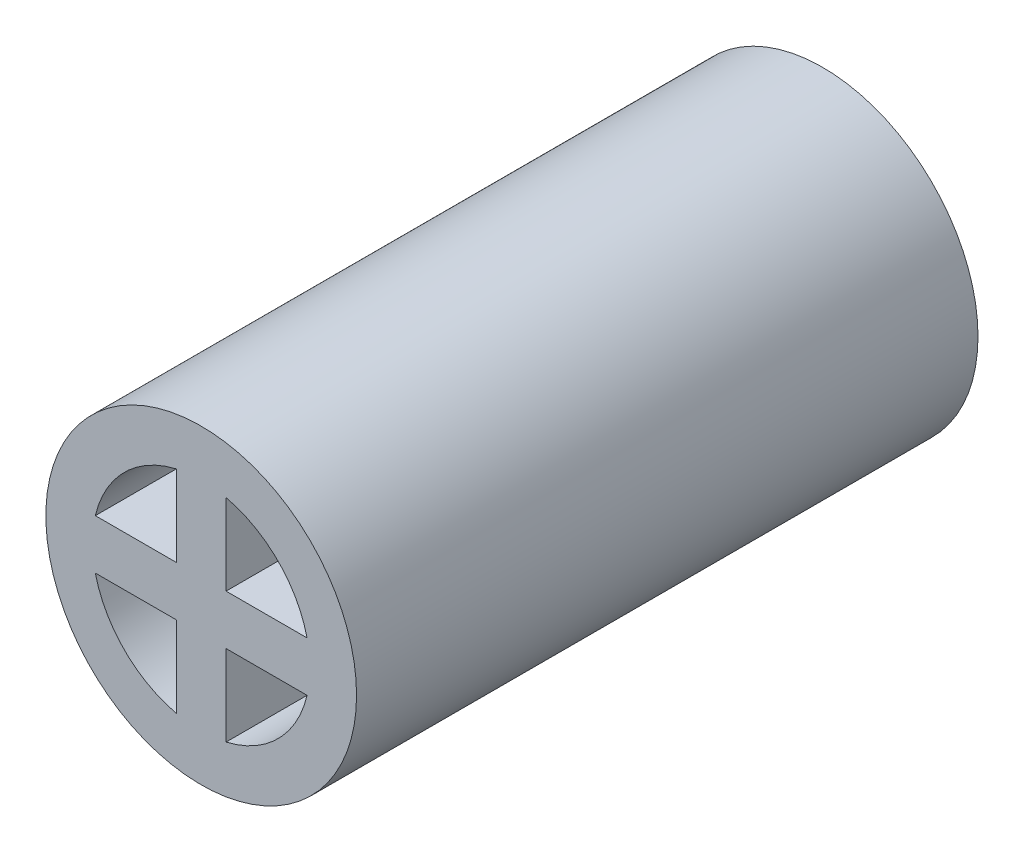
ISO-10303-21;
HEADER;
FILE_DESCRIPTION(('STEP AP214'),'2;1');
FILE_NAME('part.step','',(''),(''),'','','');
FILE_SCHEMA(('AUTOMOTIVE_DESIGN { 1 0 10303 214 1 1 1 1 }'));
ENDSEC;
DATA;
#1=APPLICATION_CONTEXT('core data for automotive mechanical design processes');
#2=APPLICATION_PROTOCOL_DEFINITION('international standard','automotive_design',2000,#1);
#3=PRODUCT_CONTEXT('',#1,'mechanical');
#4=PRODUCT('Part','Part','',(#3));
#5=PRODUCT_RELATED_PRODUCT_CATEGORY('part','',(#4));
#6=PRODUCT_DEFINITION_FORMATION('','',#4);
#7=PRODUCT_DEFINITION_CONTEXT('part definition',#1,'design');
#8=PRODUCT_DEFINITION('design','',#6,#7);
#9=PRODUCT_DEFINITION_SHAPE('','',#8);
#10=(LENGTH_UNIT() NAMED_UNIT(*) SI_UNIT(.MILLI.,.METRE.));
#11=(NAMED_UNIT(*) PLANE_ANGLE_UNIT() SI_UNIT($,.RADIAN.));
#12=(NAMED_UNIT(*) SI_UNIT($,.STERADIAN.) SOLID_ANGLE_UNIT());
#13=UNCERTAINTY_MEASURE_WITH_UNIT(LENGTH_MEASURE(1.E-05),#10,'distance_accuracy_value','');
#14=(GEOMETRIC_REPRESENTATION_CONTEXT(3) GLOBAL_UNCERTAINTY_ASSIGNED_CONTEXT((#13)) GLOBAL_UNIT_ASSIGNED_CONTEXT((#10,
#11,#12)) REPRESENTATION_CONTEXT('',''));
#15=CARTESIAN_POINT('',(0.,0.,0.));
#16=DIRECTION('',(0.,0.,1.));
#17=DIRECTION('',(1.,0.,0.));
#18=AXIS2_PLACEMENT_3D('',#15,#16,#17);
#19=CARTESIAN_POINT('',(0.,0.,50.));
#20=DIRECTION('',(0.,0.,-1.));
#21=DIRECTION('',(-1.,0.,0.));
#22=AXIS2_PLACEMENT_3D('',#19,#20,#21);
#23=CYLINDRICAL_SURFACE('',#22,8.75);
#24=CARTESIAN_POINT('',(0.,0.,0.));
#25=DIRECTION('',(0.,0.,1.));
#26=DIRECTION('',(1.,0.,0.));
#27=AXIS2_PLACEMENT_3D('',#24,#25,#26);
#28=CIRCLE('',#27,8.75);
#29=CARTESIAN_POINT('',(-2.,8.51836251870041,0.));
#30=VERTEX_POINT('',#29);
#31=CARTESIAN_POINT('',(-8.51836251870041,2.,0.));
#32=VERTEX_POINT('',#31);
#33=EDGE_CURVE('E202',#30,#32,#28,.T.);
#34=ORIENTED_EDGE('',*,*,#33,.F.);
#35=DIRECTION('',(0.,0.,-1.));
#36=VECTOR('',#35,1.);
#37=CARTESIAN_POINT('',(-2.,8.51836251870041,74.7487373415292));
#38=LINE('',#37,#36);
#39=CARTESIAN_POINT('',(-2.,8.51836251870041,50.));
#40=VERTEX_POINT('',#39);
#41=EDGE_CURVE('E172',#40,#30,#38,.T.);
#42=ORIENTED_EDGE('',*,*,#41,.F.);
#43=CARTESIAN_POINT('',(0.,0.,50.));
#44=DIRECTION('',(0.,0.,1.));
#45=DIRECTION('',(1.,0.,0.));
#46=AXIS2_PLACEMENT_3D('',#43,#44,#45);
#47=CIRCLE('',#46,8.75);
#48=CARTESIAN_POINT('',(-8.51836251870041,2.,50.));
#49=VERTEX_POINT('',#48);
#50=EDGE_CURVE('E199',#40,#49,#47,.T.);
#51=ORIENTED_EDGE('',*,*,#50,.T.);
#52=DIRECTION('',(0.,0.,-1.));
#53=VECTOR('',#52,1.);
#54=CARTESIAN_POINT('',(-8.51836251870041,2.,74.7487373415292));
#55=LINE('',#54,#53);
#56=EDGE_CURVE('E178',#49,#32,#55,.T.);
#57=ORIENTED_EDGE('',*,*,#56,.T.);
#58=EDGE_LOOP('',(#34,#42,#51,#57));
#59=FACE_BOUND('',#58,.T.);
#60=ADVANCED_FACE('F35',(#59),#23,.F.);
#61=CARTESIAN_POINT('',(-8.51836251870041,-2.,0.));
#62=VERTEX_POINT('',#61);
#63=CARTESIAN_POINT('',(-2.,-8.51836251870041,0.));
#64=VERTEX_POINT('',#63);
#65=EDGE_CURVE('E149',#62,#64,#28,.T.);
#66=ORIENTED_EDGE('',*,*,#65,.F.);
#67=DIRECTION('',(0.,0.,-1.));
#68=VECTOR('',#67,1.);
#69=CARTESIAN_POINT('',(-8.51836251870042,-2.,74.7487373415292));
#70=LINE('',#69,#68);
#71=CARTESIAN_POINT('',(-8.51836251870042,-2.,50.));
#72=VERTEX_POINT('',#71);
#73=EDGE_CURVE('E180',#72,#62,#70,.T.);
#74=ORIENTED_EDGE('',*,*,#73,.F.);
#75=CARTESIAN_POINT('',(-2.,-8.51836251870041,50.));
#76=VERTEX_POINT('',#75);
#77=EDGE_CURVE('E204',#72,#76,#47,.T.);
#78=ORIENTED_EDGE('',*,*,#77,.T.);
#79=DIRECTION('',(0.,0.,-1.));
#80=VECTOR('',#79,1.);
#81=CARTESIAN_POINT('',(-2.,-8.51836251870041,74.7487373415292));
#82=LINE('',#81,#80);
#83=EDGE_CURVE('E187',#76,#64,#82,.T.);
#84=ORIENTED_EDGE('',*,*,#83,.T.);
#85=EDGE_LOOP('',(#66,#74,#78,#84));
#86=FACE_BOUND('',#85,.T.);
#87=ADVANCED_FACE('F239',(#86),#23,.F.);
#88=CARTESIAN_POINT('',(2.,-8.51836251870041,0.));
#89=VERTEX_POINT('',#88);
#90=CARTESIAN_POINT('',(8.51836251870041,-2.,0.));
#91=VERTEX_POINT('',#90);
#92=EDGE_CURVE('E54',#89,#91,#28,.T.);
#93=ORIENTED_EDGE('',*,*,#92,.F.);
#94=DIRECTION('',(0.,0.,-1.));
#95=VECTOR('',#94,1.);
#96=CARTESIAN_POINT('',(2.,-8.51836251870041,74.7487373415292));
#97=LINE('',#96,#95);
#98=CARTESIAN_POINT('',(2.,-8.51836251870041,50.));
#99=VERTEX_POINT('',#98);
#100=EDGE_CURVE('E189',#99,#89,#97,.T.);
#101=ORIENTED_EDGE('',*,*,#100,.F.);
#102=CARTESIAN_POINT('',(8.51836251870041,-2.,50.));
#103=VERTEX_POINT('',#102);
#104=EDGE_CURVE('E200',#99,#103,#47,.T.);
#105=ORIENTED_EDGE('',*,*,#104,.T.);
#106=DIRECTION('',(0.,0.,-1.));
#107=VECTOR('',#106,1.);
#108=CARTESIAN_POINT('',(8.51836251870041,-2.,74.7487373415292));
#109=LINE('',#108,#107);
#110=EDGE_CURVE('E50',#103,#91,#109,.T.);
#111=ORIENTED_EDGE('',*,*,#110,.T.);
#112=EDGE_LOOP('',(#93,#101,#105,#111));
#113=FACE_BOUND('',#112,.T.);
#114=ADVANCED_FACE('F260',(#113),#23,.F.);
#115=CARTESIAN_POINT('',(8.51836251870041,2.,0.));
#116=VERTEX_POINT('',#115);
#117=CARTESIAN_POINT('',(2.,8.51836251870041,0.));
#118=VERTEX_POINT('',#117);
#119=EDGE_CURVE('E151',#116,#118,#28,.T.);
#120=ORIENTED_EDGE('',*,*,#119,.F.);
#121=DIRECTION('',(0.,0.,-1.));
#122=VECTOR('',#121,1.);
#123=CARTESIAN_POINT('',(8.51836251870041,2.,74.7487373415292));
#124=LINE('',#123,#122);
#125=CARTESIAN_POINT('',(8.51836251870041,2.,50.));
#126=VERTEX_POINT('',#125);
#127=EDGE_CURVE('E196',#126,#116,#124,.T.);
#128=ORIENTED_EDGE('',*,*,#127,.F.);
#129=CARTESIAN_POINT('',(2.,8.51836251870041,50.));
#130=VERTEX_POINT('',#129);
#131=EDGE_CURVE('E145',#126,#130,#47,.T.);
#132=ORIENTED_EDGE('',*,*,#131,.T.);
#133=DIRECTION('',(0.,0.,-1.));
#134=VECTOR('',#133,1.);
#135=CARTESIAN_POINT('',(2.,8.51836251870041,74.7487373415292));
#136=LINE('',#135,#134);
#137=EDGE_CURVE('E140',#130,#118,#136,.T.);
#138=ORIENTED_EDGE('',*,*,#137,.T.);
#139=EDGE_LOOP('',(#120,#128,#132,#138));
#140=FACE_BOUND('',#139,.T.);
#141=ADVANCED_FACE('F256',(#140),#23,.F.);
#142=CARTESIAN_POINT('',(0.,0.,50.));
#143=DIRECTION('',(0.,0.,1.));
#144=DIRECTION('',(1.,0.,0.));
#145=AXIS2_PLACEMENT_3D('',#142,#143,#144);
#146=PLANE('',#145);
#147=ORIENTED_EDGE('',*,*,#50,.F.);
#148=DIRECTION('',(0.,-1.,0.));
#149=VECTOR('',#148,1.);
#150=CARTESIAN_POINT('',(-2.,2.,50.));
#151=LINE('',#150,#149);
#152=CARTESIAN_POINT('',(-2.,2.,50.));
#153=VERTEX_POINT('',#152);
#154=EDGE_CURVE('E142',#40,#153,#151,.T.);
#155=ORIENTED_EDGE('',*,*,#154,.T.);
#156=DIRECTION('',(-1.,0.,0.));
#157=VECTOR('',#156,1.);
#158=CARTESIAN_POINT('',(-2.,2.,50.));
#159=LINE('',#158,#157);
#160=EDGE_CURVE('E167',#153,#49,#159,.T.);
#161=ORIENTED_EDGE('',*,*,#160,.T.);
#162=EDGE_LOOP('',(#147,#155,#161));
#163=FACE_BOUND('',#162,.T.);
#164=ORIENTED_EDGE('',*,*,#77,.F.);
#165=DIRECTION('',(1.,0.,0.));
#166=VECTOR('',#165,1.);
#167=CARTESIAN_POINT('',(-2.,-2.,50.));
#168=LINE('',#167,#166);
#169=CARTESIAN_POINT('',(-2.,-2.,50.));
#170=VERTEX_POINT('',#169);
#171=EDGE_CURVE('E164',#72,#170,#168,.T.);
#172=ORIENTED_EDGE('',*,*,#171,.T.);
#173=DIRECTION('',(0.,-1.,0.));
#174=VECTOR('',#173,1.);
#175=CARTESIAN_POINT('',(-2.,-8.51836251870041,50.));
#176=LINE('',#175,#174);
#177=EDGE_CURVE('E161',#170,#76,#176,.T.);
#178=ORIENTED_EDGE('',*,*,#177,.T.);
#179=EDGE_LOOP('',(#164,#172,#178));
#180=FACE_BOUND('',#179,.T.);
#181=ORIENTED_EDGE('',*,*,#104,.F.);
#182=DIRECTION('',(0.,1.,0.));
#183=VECTOR('',#182,1.);
#184=CARTESIAN_POINT('',(2.,-8.51836251870041,50.));
#185=LINE('',#184,#183);
#186=CARTESIAN_POINT('',(2.,-2.,50.));
#187=VERTEX_POINT('',#186);
#188=EDGE_CURVE('E153',#99,#187,#185,.T.);
#189=ORIENTED_EDGE('',*,*,#188,.T.);
#190=DIRECTION('',(1.,0.,0.));
#191=VECTOR('',#190,1.);
#192=CARTESIAN_POINT('',(8.51836251870041,-2.,50.));
#193=LINE('',#192,#191);
#194=EDGE_CURVE('E147',#187,#103,#193,.T.);
#195=ORIENTED_EDGE('',*,*,#194,.T.);
#196=EDGE_LOOP('',(#181,#189,#195));
#197=FACE_BOUND('',#196,.T.);
#198=CARTESIAN_POINT('',(0.,0.,50.));
#199=DIRECTION('',(0.,0.,1.));
#200=DIRECTION('',(1.,0.,0.));
#201=AXIS2_PLACEMENT_3D('',#198,#199,#200);
#202=CIRCLE('',#201,12.5);
#203=CARTESIAN_POINT('',(12.5,0.,50.));
#204=VERTEX_POINT('',#203);
#205=EDGE_CURVE('E11',#204,#204,#202,.T.);
#206=ORIENTED_EDGE('',*,*,#205,.T.);
#207=EDGE_LOOP('',(#206));
#208=FACE_BOUND('',#207,.T.);
#209=ORIENTED_EDGE('',*,*,#131,.F.);
#210=DIRECTION('',(-1.,0.,0.));
#211=VECTOR('',#210,1.);
#212=CARTESIAN_POINT('',(8.51836251870041,2.,50.));
#213=LINE('',#212,#211);
#214=CARTESIAN_POINT('',(2.,2.,50.));
#215=VERTEX_POINT('',#214);
#216=EDGE_CURVE('E128',#126,#215,#213,.T.);
#217=ORIENTED_EDGE('',*,*,#216,.T.);
#218=DIRECTION('',(0.,1.,0.));
#219=VECTOR('',#218,1.);
#220=CARTESIAN_POINT('',(2.,2.,50.));
#221=LINE('',#220,#219);
#222=EDGE_CURVE('E138',#215,#130,#221,.T.);
#223=ORIENTED_EDGE('',*,*,#222,.T.);
#224=EDGE_LOOP('',(#209,#217,#223));
#225=FACE_BOUND('',#224,.T.);
#226=ADVANCED_FACE('F144',(#163,#180,#197,#208,#225),#146,.T.);
#227=CARTESIAN_POINT('',(0.,0.,0.));
#228=DIRECTION('',(0.,0.,1.));
#229=DIRECTION('',(1.,0.,0.));
#230=AXIS2_PLACEMENT_3D('',#227,#228,#229);
#231=PLANE('',#230);
#232=DIRECTION('',(0.,-1.,0.));
#233=VECTOR('',#232,1.);
#234=CARTESIAN_POINT('',(-2.,2.,0.));
#235=LINE('',#234,#233);
#236=CARTESIAN_POINT('',(-2.,2.,0.));
#237=VERTEX_POINT('',#236);
#238=EDGE_CURVE('E156',#30,#237,#235,.T.);
#239=ORIENTED_EDGE('',*,*,#238,.F.);
#240=ORIENTED_EDGE('',*,*,#33,.T.);
#241=DIRECTION('',(-1.,0.,0.));
#242=VECTOR('',#241,1.);
#243=CARTESIAN_POINT('',(-2.,2.,0.));
#244=LINE('',#243,#242);
#245=EDGE_CURVE('E177',#237,#32,#244,.T.);
#246=ORIENTED_EDGE('',*,*,#245,.F.);
#247=EDGE_LOOP('',(#239,#240,#246));
#248=FACE_BOUND('',#247,.T.);
#249=DIRECTION('',(1.,0.,0.));
#250=VECTOR('',#249,1.);
#251=CARTESIAN_POINT('',(-2.,-2.,0.));
#252=LINE('',#251,#250);
#253=CARTESIAN_POINT('',(-2.,-2.,0.));
#254=VERTEX_POINT('',#253);
#255=EDGE_CURVE('E183',#62,#254,#252,.T.);
#256=ORIENTED_EDGE('',*,*,#255,.F.);
#257=ORIENTED_EDGE('',*,*,#65,.T.);
#258=DIRECTION('',(0.,-1.,0.));
#259=VECTOR('',#258,1.);
#260=CARTESIAN_POINT('',(-2.,-8.51836251870041,0.));
#261=LINE('',#260,#259);
#262=EDGE_CURVE('E186',#254,#64,#261,.T.);
#263=ORIENTED_EDGE('',*,*,#262,.F.);
#264=EDGE_LOOP('',(#256,#257,#263));
#265=FACE_BOUND('',#264,.T.);
#266=DIRECTION('',(0.,1.,0.));
#267=VECTOR('',#266,1.);
#268=CARTESIAN_POINT('',(2.,-8.51836251870041,0.));
#269=LINE('',#268,#267);
#270=CARTESIAN_POINT('',(2.,-2.,0.));
#271=VERTEX_POINT('',#270);
#272=EDGE_CURVE('E191',#89,#271,#269,.T.);
#273=ORIENTED_EDGE('',*,*,#272,.F.);
#274=ORIENTED_EDGE('',*,*,#92,.T.);
#275=DIRECTION('',(1.,0.,0.));
#276=VECTOR('',#275,1.);
#277=CARTESIAN_POINT('',(8.51836251870041,-2.,0.));
#278=LINE('',#277,#276);
#279=EDGE_CURVE('E194',#271,#91,#278,.T.);
#280=ORIENTED_EDGE('',*,*,#279,.F.);
#281=EDGE_LOOP('',(#273,#274,#280));
#282=FACE_BOUND('',#281,.T.);
#283=CARTESIAN_POINT('',(0.,0.,0.));
#284=DIRECTION('',(0.,0.,1.));
#285=DIRECTION('',(1.,0.,0.));
#286=AXIS2_PLACEMENT_3D('',#283,#284,#285);
#287=CIRCLE('',#286,12.5);
#288=CARTESIAN_POINT('',(12.5,0.,0.));
#289=VERTEX_POINT('',#288);
#290=EDGE_CURVE('E39',#289,#289,#287,.T.);
#291=ORIENTED_EDGE('',*,*,#290,.F.);
#292=EDGE_LOOP('',(#291));
#293=FACE_BOUND('',#292,.T.);
#294=ORIENTED_EDGE('',*,*,#119,.T.);
#295=DIRECTION('',(0.,1.,0.));
#296=VECTOR('',#295,1.);
#297=CARTESIAN_POINT('',(2.,2.,0.));
#298=LINE('',#297,#296);
#299=CARTESIAN_POINT('',(2.,2.,0.));
#300=VERTEX_POINT('',#299);
#301=EDGE_CURVE('E134',#300,#118,#298,.T.);
#302=ORIENTED_EDGE('',*,*,#301,.F.);
#303=DIRECTION('',(-1.,0.,0.));
#304=VECTOR('',#303,1.);
#305=CARTESIAN_POINT('',(8.51836251870041,2.,0.));
#306=LINE('',#305,#304);
#307=EDGE_CURVE('E130',#116,#300,#306,.T.);
#308=ORIENTED_EDGE('',*,*,#307,.F.);
#309=EDGE_LOOP('',(#294,#302,#308));
#310=FACE_BOUND('',#309,.T.);
#311=ADVANCED_FACE('F215',(#248,#265,#282,#293,#310),#231,.F.);
#312=CARTESIAN_POINT('',(0.,0.,50.));
#313=DIRECTION('',(0.,0.,-1.));
#314=DIRECTION('',(-1.,0.,0.));
#315=AXIS2_PLACEMENT_3D('',#312,#313,#314);
#316=CYLINDRICAL_SURFACE('',#315,12.5);
#317=ORIENTED_EDGE('',*,*,#205,.F.);
#318=EDGE_LOOP('',(#317));
#319=FACE_BOUND('',#318,.T.);
#320=ORIENTED_EDGE('',*,*,#290,.T.);
#321=EDGE_LOOP('',(#320));
#322=FACE_BOUND('',#321,.T.);
#323=ADVANCED_FACE('F37',(#319,#322),#316,.T.);
#324=CARTESIAN_POINT('',(-2.,2.,74.7487373415292));
#325=DIRECTION('',(1.,0.,0.));
#326=DIRECTION('',(0.,1.,0.));
#327=AXIS2_PLACEMENT_3D('',#324,#325,#326);
#328=PLANE('',#327);
#329=ORIENTED_EDGE('',*,*,#154,.F.);
#330=ORIENTED_EDGE('',*,*,#41,.T.);
#331=ORIENTED_EDGE('',*,*,#238,.T.);
#332=DIRECTION('',(0.,0.,-1.));
#333=VECTOR('',#332,1.);
#334=CARTESIAN_POINT('',(-2.,2.,74.7487373415292));
#335=LINE('',#334,#333);
#336=EDGE_CURVE('E175',#153,#237,#335,.T.);
#337=ORIENTED_EDGE('',*,*,#336,.F.);
#338=EDGE_LOOP('',(#329,#330,#331,#337));
#339=FACE_BOUND('',#338,.T.);
#340=ADVANCED_FACE('F235',(#339),#328,.F.);
#341=CARTESIAN_POINT('',(-2.,2.,74.7487373415292));
#342=DIRECTION('',(0.,-1.,0.));
#343=DIRECTION('',(1.,0.,0.));
#344=AXIS2_PLACEMENT_3D('',#341,#342,#343);
#345=PLANE('',#344);
#346=ORIENTED_EDGE('',*,*,#160,.F.);
#347=ORIENTED_EDGE('',*,*,#336,.T.);
#348=ORIENTED_EDGE('',*,*,#245,.T.);
#349=ORIENTED_EDGE('',*,*,#56,.F.);
#350=EDGE_LOOP('',(#346,#347,#348,#349));
#351=FACE_BOUND('',#350,.T.);
#352=ADVANCED_FACE('F230',(#351),#345,.F.);
#353=CARTESIAN_POINT('',(-2.,-2.,74.7487373415292));
#354=DIRECTION('',(0.,1.,0.));
#355=DIRECTION('',(0.,0.,1.));
#356=AXIS2_PLACEMENT_3D('',#353,#354,#355);
#357=PLANE('',#356);
#358=ORIENTED_EDGE('',*,*,#171,.F.);
#359=ORIENTED_EDGE('',*,*,#73,.T.);
#360=ORIENTED_EDGE('',*,*,#255,.T.);
#361=DIRECTION('',(0.,0.,-1.));
#362=VECTOR('',#361,1.);
#363=CARTESIAN_POINT('',(-2.,-2.,74.7487373415292));
#364=LINE('',#363,#362);
#365=EDGE_CURVE('E184',#170,#254,#364,.T.);
#366=ORIENTED_EDGE('',*,*,#365,.F.);
#367=EDGE_LOOP('',(#358,#359,#360,#366));
#368=FACE_BOUND('',#367,.T.);
#369=ADVANCED_FACE('F244',(#368),#357,.F.);
#370=CARTESIAN_POINT('',(-2.,-8.51836251870041,74.7487373415292));
#371=DIRECTION('',(1.,0.,0.));
#372=DIRECTION('',(0.,1.,0.));
#373=AXIS2_PLACEMENT_3D('',#370,#371,#372);
#374=PLANE('',#373);
#375=ORIENTED_EDGE('',*,*,#177,.F.);
#376=ORIENTED_EDGE('',*,*,#365,.T.);
#377=ORIENTED_EDGE('',*,*,#262,.T.);
#378=ORIENTED_EDGE('',*,*,#83,.F.);
#379=EDGE_LOOP('',(#375,#376,#377,#378));
#380=FACE_BOUND('',#379,.T.);
#381=ADVANCED_FACE('F222',(#380),#374,.F.);
#382=CARTESIAN_POINT('',(2.,-8.51836251870041,74.7487373415292));
#383=DIRECTION('',(-1.,0.,0.));
#384=DIRECTION('',(0.,-1.,0.));
#385=AXIS2_PLACEMENT_3D('',#382,#383,#384);
#386=PLANE('',#385);
#387=ORIENTED_EDGE('',*,*,#188,.F.);
#388=ORIENTED_EDGE('',*,*,#100,.T.);
#389=ORIENTED_EDGE('',*,*,#272,.T.);
#390=DIRECTION('',(0.,0.,-1.));
#391=VECTOR('',#390,1.);
#392=CARTESIAN_POINT('',(2.,-2.,74.7487373415292));
#393=LINE('',#392,#391);
#394=EDGE_CURVE('E192',#187,#271,#393,.T.);
#395=ORIENTED_EDGE('',*,*,#394,.F.);
#396=EDGE_LOOP('',(#387,#388,#389,#395));
#397=FACE_BOUND('',#396,.T.);
#398=ADVANCED_FACE('F251',(#397),#386,.F.);
#399=CARTESIAN_POINT('',(8.51836251870041,-2.,74.7487373415292));
#400=DIRECTION('',(0.,1.,0.));
#401=DIRECTION('',(0.,0.,1.));
#402=AXIS2_PLACEMENT_3D('',#399,#400,#401);
#403=PLANE('',#402);
#404=ORIENTED_EDGE('',*,*,#194,.F.);
#405=ORIENTED_EDGE('',*,*,#394,.T.);
#406=ORIENTED_EDGE('',*,*,#279,.T.);
#407=ORIENTED_EDGE('',*,*,#110,.F.);
#408=EDGE_LOOP('',(#404,#405,#406,#407));
#409=FACE_BOUND('',#408,.T.);
#410=ADVANCED_FACE('F274',(#409),#403,.F.);
#411=CARTESIAN_POINT('',(8.51836251870041,2.,74.7487373415292));
#412=DIRECTION('',(0.,-1.,0.));
#413=DIRECTION('',(0.,0.,-1.));
#414=AXIS2_PLACEMENT_3D('',#411,#412,#413);
#415=PLANE('',#414);
#416=ORIENTED_EDGE('',*,*,#216,.F.);
#417=ORIENTED_EDGE('',*,*,#127,.T.);
#418=ORIENTED_EDGE('',*,*,#307,.T.);
#419=DIRECTION('',(0.,0.,-1.));
#420=VECTOR('',#419,1.);
#421=CARTESIAN_POINT('',(2.,2.,74.7487373415292));
#422=LINE('',#421,#420);
#423=EDGE_CURVE('E123',#215,#300,#422,.T.);
#424=ORIENTED_EDGE('',*,*,#423,.F.);
#425=EDGE_LOOP('',(#416,#417,#418,#424));
#426=FACE_BOUND('',#425,.T.);
#427=ADVANCED_FACE('F125',(#426),#415,.F.);
#428=CARTESIAN_POINT('',(2.,2.,74.7487373415292));
#429=DIRECTION('',(-1.,0.,0.));
#430=DIRECTION('',(0.,-1.,0.));
#431=AXIS2_PLACEMENT_3D('',#428,#429,#430);
#432=PLANE('',#431);
#433=ORIENTED_EDGE('',*,*,#222,.F.);
#434=ORIENTED_EDGE('',*,*,#423,.T.);
#435=ORIENTED_EDGE('',*,*,#301,.T.);
#436=ORIENTED_EDGE('',*,*,#137,.F.);
#437=EDGE_LOOP('',(#433,#434,#435,#436));
#438=FACE_BOUND('',#437,.T.);
#439=ADVANCED_FACE('F139',(#438),#432,.F.);
#440=CLOSED_SHELL('',(#60,#87,#114,#141,#226,#311,#323,#340,#352,#369,#381,#398,#410,#427,#439));
#441=MANIFOLD_SOLID_BREP('B2',#440);
#442=ADVANCED_BREP_SHAPE_REPRESENTATION('',(#18,#441),#14);
#443=SHAPE_DEFINITION_REPRESENTATION(#9,#442);
ENDSEC;
END-ISO-10303-21;
